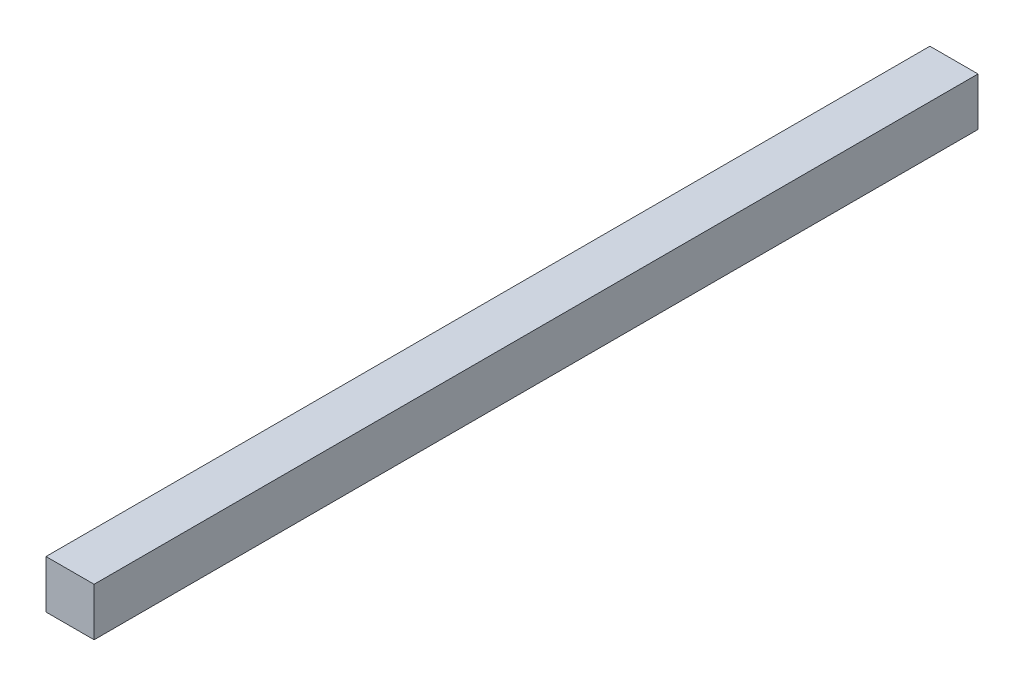
ISO-10303-21;
HEADER;
FILE_DESCRIPTION(('STEP AP214'),'2;1');
FILE_NAME('part.step','',(''),(''),'','','');
FILE_SCHEMA(('AUTOMOTIVE_DESIGN { 1 0 10303 214 1 1 1 1 }'));
ENDSEC;
DATA;
#1=APPLICATION_CONTEXT('core data for automotive mechanical design processes');
#2=APPLICATION_PROTOCOL_DEFINITION('international standard','automotive_design',2000,#1);
#3=PRODUCT_CONTEXT('',#1,'mechanical');
#4=PRODUCT('Part','Part','',(#3));
#5=PRODUCT_RELATED_PRODUCT_CATEGORY('part','',(#4));
#6=PRODUCT_DEFINITION_FORMATION('','',#4);
#7=PRODUCT_DEFINITION_CONTEXT('part definition',#1,'design');
#8=PRODUCT_DEFINITION('design','',#6,#7);
#9=PRODUCT_DEFINITION_SHAPE('','',#8);
#10=(LENGTH_UNIT() NAMED_UNIT(*) SI_UNIT(.MILLI.,.METRE.));
#11=(NAMED_UNIT(*) PLANE_ANGLE_UNIT() SI_UNIT($,.RADIAN.));
#12=(NAMED_UNIT(*) SI_UNIT($,.STERADIAN.) SOLID_ANGLE_UNIT());
#13=UNCERTAINTY_MEASURE_WITH_UNIT(LENGTH_MEASURE(1.E-05),#10,'distance_accuracy_value','');
#14=(GEOMETRIC_REPRESENTATION_CONTEXT(3) GLOBAL_UNCERTAINTY_ASSIGNED_CONTEXT((#13)) GLOBAL_UNIT_ASSIGNED_CONTEXT((#10,
#11,#12)) REPRESENTATION_CONTEXT('',''));
#15=CARTESIAN_POINT('',(0.,0.,0.));
#16=DIRECTION('',(0.,0.,1.));
#17=DIRECTION('',(1.,0.,0.));
#18=AXIS2_PLACEMENT_3D('',#15,#16,#17);
#19=CARTESIAN_POINT('',(0.,0.,58.35));
#20=DIRECTION('',(1.,0.,0.));
#21=DIRECTION('',(0.,0.,-1.));
#22=AXIS2_PLACEMENT_3D('',#19,#20,#21);
#23=PLANE('',#22);
#24=DIRECTION('',(0.,-1.,0.));
#25=VECTOR('',#24,1.);
#26=CARTESIAN_POINT('',(0.,0.,0.));
#27=LINE('',#26,#25);
#28=CARTESIAN_POINT('',(0.,3.175,0.));
#29=VERTEX_POINT('',#28);
#30=CARTESIAN_POINT('',(0.,0.,0.));
#31=VERTEX_POINT('',#30);
#32=EDGE_CURVE('E107',#29,#31,#27,.T.);
#33=ORIENTED_EDGE('',*,*,#32,.T.);
#34=DIRECTION('',(0.,0.,-1.));
#35=VECTOR('',#34,1.);
#36=CARTESIAN_POINT('',(0.,0.,58.35));
#37=LINE('',#36,#35);
#38=CARTESIAN_POINT('',(0.,0.,58.35));
#39=VERTEX_POINT('',#38);
#40=EDGE_CURVE('E11',#39,#31,#37,.T.);
#41=ORIENTED_EDGE('',*,*,#40,.F.);
#42=DIRECTION('',(0.,-1.,0.));
#43=VECTOR('',#42,1.);
#44=CARTESIAN_POINT('',(0.,0.,58.35));
#45=LINE('',#44,#43);
#46=CARTESIAN_POINT('',(0.,3.175,58.35));
#47=VERTEX_POINT('',#46);
#48=EDGE_CURVE('E91',#47,#39,#45,.T.);
#49=ORIENTED_EDGE('',*,*,#48,.F.);
#50=DIRECTION('',(0.,0.,-1.));
#51=VECTOR('',#50,1.);
#52=CARTESIAN_POINT('',(0.,3.175,58.35));
#53=LINE('',#52,#51);
#54=EDGE_CURVE('E103',#47,#29,#53,.T.);
#55=ORIENTED_EDGE('',*,*,#54,.T.);
#56=EDGE_LOOP('',(#33,#41,#49,#55));
#57=FACE_BOUND('',#56,.T.);
#58=ADVANCED_FACE('F39',(#57),#23,.F.);
#59=CARTESIAN_POINT('',(0.,0.,58.35));
#60=DIRECTION('',(0.,1.,0.));
#61=DIRECTION('',(0.,0.,1.));
#62=AXIS2_PLACEMENT_3D('',#59,#60,#61);
#63=PLANE('',#62);
#64=DIRECTION('',(1.,0.,0.));
#65=VECTOR('',#64,1.);
#66=CARTESIAN_POINT('',(0.,0.,0.));
#67=LINE('',#66,#65);
#68=CARTESIAN_POINT('',(3.175,0.,0.));
#69=VERTEX_POINT('',#68);
#70=EDGE_CURVE('E96',#31,#69,#67,.T.);
#71=ORIENTED_EDGE('',*,*,#70,.T.);
#72=DIRECTION('',(0.,0.,-1.));
#73=VECTOR('',#72,1.);
#74=CARTESIAN_POINT('',(3.175,0.,58.35));
#75=LINE('',#74,#73);
#76=CARTESIAN_POINT('',(3.175,0.,58.35));
#77=VERTEX_POINT('',#76);
#78=EDGE_CURVE('E48',#77,#69,#75,.T.);
#79=ORIENTED_EDGE('',*,*,#78,.F.);
#80=DIRECTION('',(1.,0.,0.));
#81=VECTOR('',#80,1.);
#82=CARTESIAN_POINT('',(0.,0.,58.35));
#83=LINE('',#82,#81);
#84=EDGE_CURVE('E86',#39,#77,#83,.T.);
#85=ORIENTED_EDGE('',*,*,#84,.F.);
#86=ORIENTED_EDGE('',*,*,#40,.T.);
#87=EDGE_LOOP('',(#71,#79,#85,#86));
#88=FACE_BOUND('',#87,.T.);
#89=ADVANCED_FACE('F95',(#88),#63,.F.);
#90=CARTESIAN_POINT('',(3.175,0.,58.35));
#91=DIRECTION('',(-1.,0.,0.));
#92=DIRECTION('',(0.,0.,1.));
#93=AXIS2_PLACEMENT_3D('',#90,#91,#92);
#94=PLANE('',#93);
#95=DIRECTION('',(0.,1.,0.));
#96=VECTOR('',#95,1.);
#97=CARTESIAN_POINT('',(3.175,0.,0.));
#98=LINE('',#97,#96);
#99=CARTESIAN_POINT('',(3.175,3.175,0.));
#100=VERTEX_POINT('',#99);
#101=EDGE_CURVE('E73',#69,#100,#98,.T.);
#102=ORIENTED_EDGE('',*,*,#101,.T.);
#103=DIRECTION('',(0.,0.,-1.));
#104=VECTOR('',#103,1.);
#105=CARTESIAN_POINT('',(3.175,3.175,58.35));
#106=LINE('',#105,#104);
#107=CARTESIAN_POINT('',(3.175,3.175,58.35));
#108=VERTEX_POINT('',#107);
#109=EDGE_CURVE('E98',#108,#100,#106,.T.);
#110=ORIENTED_EDGE('',*,*,#109,.F.);
#111=DIRECTION('',(0.,1.,0.));
#112=VECTOR('',#111,1.);
#113=CARTESIAN_POINT('',(3.175,0.,58.35));
#114=LINE('',#113,#112);
#115=EDGE_CURVE('E89',#77,#108,#114,.T.);
#116=ORIENTED_EDGE('',*,*,#115,.F.);
#117=ORIENTED_EDGE('',*,*,#78,.T.);
#118=EDGE_LOOP('',(#102,#110,#116,#117));
#119=FACE_BOUND('',#118,.T.);
#120=ADVANCED_FACE('F99',(#119),#94,.F.);
#121=CARTESIAN_POINT('',(0.,3.175,58.35));
#122=DIRECTION('',(0.,-1.,0.));
#123=DIRECTION('',(0.,0.,-1.));
#124=AXIS2_PLACEMENT_3D('',#121,#122,#123);
#125=PLANE('',#124);
#126=DIRECTION('',(-1.,0.,0.));
#127=VECTOR('',#126,1.);
#128=CARTESIAN_POINT('',(0.,3.175,0.));
#129=LINE('',#128,#127);
#130=EDGE_CURVE('E79',#100,#29,#129,.T.);
#131=ORIENTED_EDGE('',*,*,#130,.T.);
#132=ORIENTED_EDGE('',*,*,#54,.F.);
#133=DIRECTION('',(-1.,0.,0.));
#134=VECTOR('',#133,1.);
#135=CARTESIAN_POINT('',(0.,3.175,58.35));
#136=LINE('',#135,#134);
#137=EDGE_CURVE('E56',#108,#47,#136,.T.);
#138=ORIENTED_EDGE('',*,*,#137,.F.);
#139=ORIENTED_EDGE('',*,*,#109,.T.);
#140=EDGE_LOOP('',(#131,#132,#138,#139));
#141=FACE_BOUND('',#140,.T.);
#142=ADVANCED_FACE('F120',(#141),#125,.F.);
#143=CARTESIAN_POINT('',(0.,0.,58.35));
#144=DIRECTION('',(0.,0.,-1.));
#145=DIRECTION('',(-1.,0.,0.));
#146=AXIS2_PLACEMENT_3D('',#143,#144,#145);
#147=PLANE('',#146);
#148=ORIENTED_EDGE('',*,*,#48,.T.);
#149=ORIENTED_EDGE('',*,*,#84,.T.);
#150=ORIENTED_EDGE('',*,*,#115,.T.);
#151=ORIENTED_EDGE('',*,*,#137,.T.);
#152=EDGE_LOOP('',(#148,#149,#150,#151));
#153=FACE_BOUND('',#152,.T.);
#154=ADVANCED_FACE('F87',(#153),#147,.F.);
#155=CARTESIAN_POINT('',(0.,0.,0.));
#156=DIRECTION('',(0.,0.,-1.));
#157=DIRECTION('',(-1.,0.,0.));
#158=AXIS2_PLACEMENT_3D('',#155,#156,#157);
#159=PLANE('',#158);
#160=ORIENTED_EDGE('',*,*,#32,.F.);
#161=ORIENTED_EDGE('',*,*,#130,.F.);
#162=ORIENTED_EDGE('',*,*,#101,.F.);
#163=ORIENTED_EDGE('',*,*,#70,.F.);
#164=EDGE_LOOP('',(#160,#161,#162,#163));
#165=FACE_BOUND('',#164,.T.);
#166=ADVANCED_FACE('F123',(#165),#159,.T.);
#167=CLOSED_SHELL('',(#58,#89,#120,#142,#154,#166));
#168=MANIFOLD_SOLID_BREP('B2',#167);
#169=ADVANCED_BREP_SHAPE_REPRESENTATION('',(#18,#168),#14);
#170=SHAPE_DEFINITION_REPRESENTATION(#9,#169);
ENDSEC;
END-ISO-10303-21;
